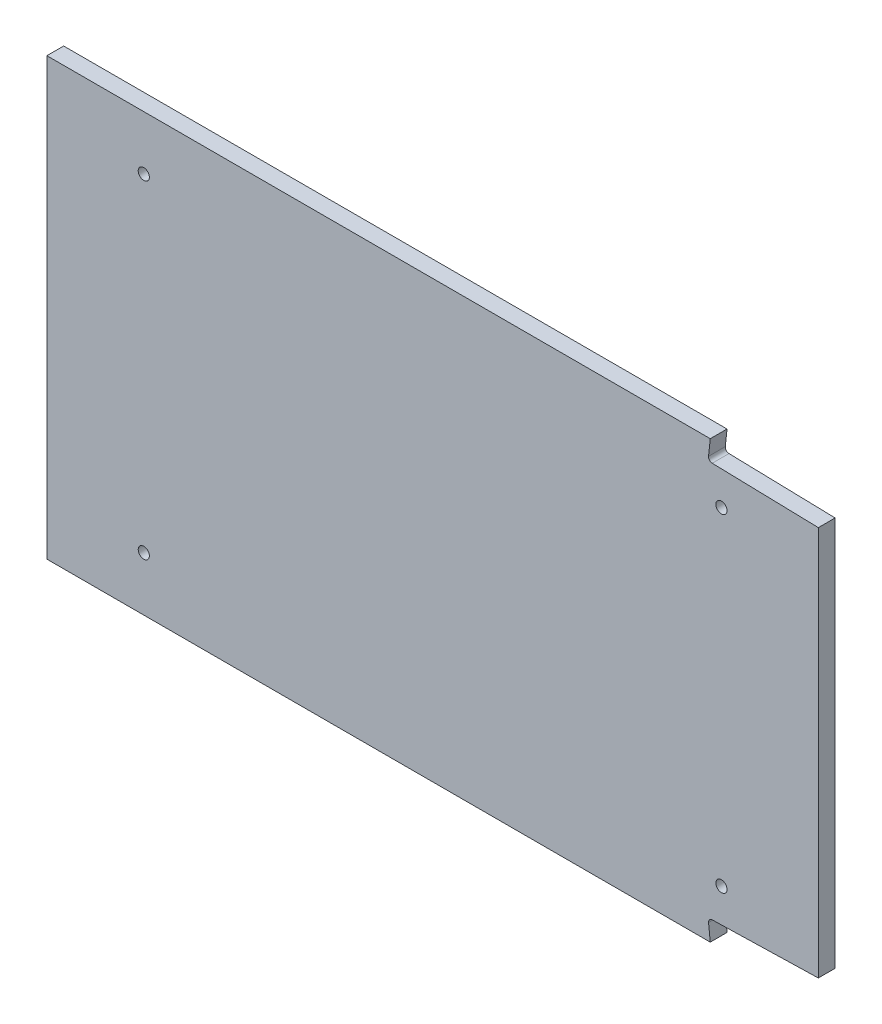
ISO-10303-21;
HEADER;
FILE_DESCRIPTION(('STEP AP214'),'2;1');
FILE_NAME('part.step','',(''),(''),'','','');
FILE_SCHEMA(('AUTOMOTIVE_DESIGN { 1 0 10303 214 1 1 1 1 }'));
ENDSEC;
DATA;
#1=APPLICATION_CONTEXT('core data for automotive mechanical design processes');
#2=APPLICATION_PROTOCOL_DEFINITION('international standard','automotive_design',2000,#1);
#3=PRODUCT_CONTEXT('',#1,'mechanical');
#4=PRODUCT('Part','Part','',(#3));
#5=PRODUCT_RELATED_PRODUCT_CATEGORY('part','',(#4));
#6=PRODUCT_DEFINITION_FORMATION('','',#4);
#7=PRODUCT_DEFINITION_CONTEXT('part definition',#1,'design');
#8=PRODUCT_DEFINITION('design','',#6,#7);
#9=PRODUCT_DEFINITION_SHAPE('','',#8);
#10=(LENGTH_UNIT() NAMED_UNIT(*) SI_UNIT(.MILLI.,.METRE.));
#11=(NAMED_UNIT(*) PLANE_ANGLE_UNIT() SI_UNIT($,.RADIAN.));
#12=(NAMED_UNIT(*) SI_UNIT($,.STERADIAN.) SOLID_ANGLE_UNIT());
#13=UNCERTAINTY_MEASURE_WITH_UNIT(LENGTH_MEASURE(1.E-05),#10,'distance_accuracy_value','');
#14=(GEOMETRIC_REPRESENTATION_CONTEXT(3) GLOBAL_UNCERTAINTY_ASSIGNED_CONTEXT((#13)) GLOBAL_UNIT_ASSIGNED_CONTEXT((#10,
#11,#12)) REPRESENTATION_CONTEXT('',''));
#15=CARTESIAN_POINT('',(0.,0.,0.));
#16=DIRECTION('',(0.,0.,1.));
#17=DIRECTION('',(1.,0.,0.));
#18=AXIS2_PLACEMENT_3D('',#15,#16,#17);
#19=CARTESIAN_POINT('',(103.5,-58.5,4.5));
#20=DIRECTION('',(0.,1.,0.));
#21=DIRECTION('',(-1.,0.,0.));
#22=AXIS2_PLACEMENT_3D('',#19,#20,#21);
#23=PLANE('',#22);
#24=DIRECTION('',(0.,0.,1.));
#25=VECTOR('',#24,1.);
#26=CARTESIAN_POINT('',(74.502602410156,-58.5,-0.00100000000000013));
#27=LINE('',#26,#25);
#28=CARTESIAN_POINT('',(74.502602410156,-58.5,0.));
#29=VERTEX_POINT('',#28);
#30=CARTESIAN_POINT('',(74.502602410156,-58.5,4.5));
#31=VERTEX_POINT('',#30);
#32=EDGE_CURVE('E115',#29,#31,#27,.T.);
#33=ORIENTED_EDGE('',*,*,#32,.T.);
#34=DIRECTION('',(1.,0.,0.));
#35=VECTOR('',#34,1.);
#36=CARTESIAN_POINT('',(103.5,-58.5,4.5));
#37=LINE('',#36,#35);
#38=CARTESIAN_POINT('',(-103.5,-58.5,4.5));
#39=VERTEX_POINT('',#38);
#40=EDGE_CURVE('E167',#39,#31,#37,.T.);
#41=ORIENTED_EDGE('',*,*,#40,.F.);
#42=DIRECTION('',(0.,0.,-1.));
#43=VECTOR('',#42,1.);
#44=CARTESIAN_POINT('',(-103.5,-58.5,4.5));
#45=LINE('',#44,#43);
#46=CARTESIAN_POINT('',(-103.5,-58.5,0.));
#47=VERTEX_POINT('',#46);
#48=EDGE_CURVE('E11',#39,#47,#45,.T.);
#49=ORIENTED_EDGE('',*,*,#48,.T.);
#50=DIRECTION('',(1.,0.,0.));
#51=VECTOR('',#50,1.);
#52=CARTESIAN_POINT('',(103.5,-58.5,0.));
#53=LINE('',#52,#51);
#54=EDGE_CURVE('E132',#47,#29,#53,.T.);
#55=ORIENTED_EDGE('',*,*,#54,.T.);
#56=EDGE_LOOP('',(#33,#41,#49,#55));
#57=FACE_BOUND('',#56,.T.);
#58=ADVANCED_FACE('F38',(#57),#23,.F.);
#59=CARTESIAN_POINT('',(103.5,-58.5,4.5));
#60=DIRECTION('',(-1.,0.,0.));
#61=DIRECTION('',(0.,0.,1.));
#62=AXIS2_PLACEMENT_3D('',#59,#60,#61);
#63=PLANE('',#62);
#64=DIRECTION('',(0.,0.,1.));
#65=VECTOR('',#64,1.);
#66=CARTESIAN_POINT('',(103.5,-52.3309475959821,-0.00100000000000013));
#67=LINE('',#66,#65);
#68=CARTESIAN_POINT('',(103.5,-52.3309475959821,0.));
#69=VERTEX_POINT('',#68);
#70=CARTESIAN_POINT('',(103.5,-52.3309475959821,4.5));
#71=VERTEX_POINT('',#70);
#72=EDGE_CURVE('E239',#69,#71,#67,.T.);
#73=ORIENTED_EDGE('',*,*,#72,.F.);
#74=DIRECTION('',(0.,1.,0.));
#75=VECTOR('',#74,1.);
#76=CARTESIAN_POINT('',(103.5,-58.5,0.));
#77=LINE('',#76,#75);
#78=CARTESIAN_POINT('',(103.5,52.3309475959821,0.));
#79=VERTEX_POINT('',#78);
#80=EDGE_CURVE('E141',#69,#79,#77,.T.);
#81=ORIENTED_EDGE('',*,*,#80,.T.);
#82=DIRECTION('',(0.,0.,1.));
#83=VECTOR('',#82,1.);
#84=CARTESIAN_POINT('',(103.5,52.3309475959821,-0.00100000000000013));
#85=LINE('',#84,#83);
#86=CARTESIAN_POINT('',(103.5,52.3309475959821,4.5));
#87=VERTEX_POINT('',#86);
#88=EDGE_CURVE('E208',#79,#87,#85,.T.);
#89=ORIENTED_EDGE('',*,*,#88,.T.);
#90=DIRECTION('',(0.,1.,0.));
#91=VECTOR('',#90,1.);
#92=CARTESIAN_POINT('',(103.5,-58.5,4.5));
#93=LINE('',#92,#91);
#94=EDGE_CURVE('E161',#71,#87,#93,.T.);
#95=ORIENTED_EDGE('',*,*,#94,.F.);
#96=EDGE_LOOP('',(#73,#81,#89,#95));
#97=FACE_BOUND('',#96,.T.);
#98=ADVANCED_FACE('F265',(#97),#63,.F.);
#99=CARTESIAN_POINT('',(0.,0.,4.5));
#100=DIRECTION('',(0.,0.,1.));
#101=DIRECTION('',(1.,0.,0.));
#102=AXIS2_PLACEMENT_3D('',#99,#100,#101);
#103=PLANE('',#102);
#104=CARTESIAN_POINT('',(77.5,-44.,4.5));
#105=DIRECTION('',(0.,0.,1.));
#106=DIRECTION('',(-1.,0.,0.));
#107=AXIS2_PLACEMENT_3D('',#104,#105,#106);
#108=CIRCLE('',#107,1.5);
#109=CARTESIAN_POINT('',(76.,-44.,4.5));
#110=VERTEX_POINT('',#109);
#111=EDGE_CURVE('E198',#110,#110,#108,.T.);
#112=ORIENTED_EDGE('',*,*,#111,.F.);
#113=EDGE_LOOP('',(#112));
#114=FACE_BOUND('',#113,.T.);
#115=CARTESIAN_POINT('',(-77.5,-44.,4.5));
#116=DIRECTION('',(0.,0.,-1.));
#117=DIRECTION('',(1.,0.,0.));
#118=AXIS2_PLACEMENT_3D('',#115,#116,#117);
#119=CIRCLE('',#118,1.5);
#120=CARTESIAN_POINT('',(-76.,-44.,4.5));
#121=VERTEX_POINT('',#120);
#122=EDGE_CURVE('E190',#121,#121,#119,.T.);
#123=ORIENTED_EDGE('',*,*,#122,.T.);
#124=EDGE_LOOP('',(#123));
#125=FACE_BOUND('',#124,.T.);
#126=CARTESIAN_POINT('',(77.5,44.,4.5));
#127=DIRECTION('',(0.,0.,-1.));
#128=DIRECTION('',(-1.,0.,0.));
#129=AXIS2_PLACEMENT_3D('',#126,#127,#128);
#130=CIRCLE('',#129,1.5);
#131=CARTESIAN_POINT('',(76.,44.,4.5));
#132=VERTEX_POINT('',#131);
#133=EDGE_CURVE('E182',#132,#132,#130,.T.);
#134=ORIENTED_EDGE('',*,*,#133,.T.);
#135=EDGE_LOOP('',(#134));
#136=FACE_BOUND('',#135,.T.);
#137=CARTESIAN_POINT('',(-77.5,44.,4.5));
#138=DIRECTION('',(0.,0.,1.));
#139=DIRECTION('',(1.,0.,0.));
#140=AXIS2_PLACEMENT_3D('',#137,#138,#139);
#141=CIRCLE('',#140,1.5);
#142=CARTESIAN_POINT('',(-76.,44.,4.5));
#143=VERTEX_POINT('',#142);
#144=EDGE_CURVE('E174',#143,#143,#141,.T.);
#145=ORIENTED_EDGE('',*,*,#144,.F.);
#146=EDGE_LOOP('',(#145));
#147=FACE_BOUND('',#146,.T.);
#148=ORIENTED_EDGE('',*,*,#40,.T.);
#149=DIRECTION('',(-0.106020446085351,0.994363949975995,0.));
#150=VECTOR('',#149,1.);
#151=CARTESIAN_POINT('',(74.502602410156,-58.5,4.5));
#152=LINE('',#151,#150);
#153=CARTESIAN_POINT('',(74.0418255120726,-54.1783813561109,4.5));
#154=VERTEX_POINT('',#153);
#155=EDGE_CURVE('E121',#31,#154,#152,.T.);
#156=ORIENTED_EDGE('',*,*,#155,.T.);
#157=CARTESIAN_POINT('',(75.0509354151962,-54.070788676307,4.5));
#158=DIRECTION('',(0.,0.,-1.));
#159=DIRECTION('',(1.,0.,0.));
#160=AXIS2_PLACEMENT_3D('',#157,#158,#159);
#161=CIRCLE('',#160,1.01482953313816);
#162=CARTESIAN_POINT('',(75.0250930692009,-53.0562882305295,4.5));
#163=VERTEX_POINT('',#162);
#164=EDGE_CURVE('E248',#154,#163,#161,.T.);
#165=ORIENTED_EDGE('',*,*,#164,.T.);
#166=DIRECTION('',(0.999675721537608,0.0254647161433701,0.));
#167=VECTOR('',#166,1.);
#168=CARTESIAN_POINT('',(75.0250930692009,-53.0562882305295,4.5));
#169=LINE('',#168,#167);
#170=EDGE_CURVE('E136',#163,#71,#169,.T.);
#171=ORIENTED_EDGE('',*,*,#170,.T.);
#172=ORIENTED_EDGE('',*,*,#94,.T.);
#173=DIRECTION('',(0.999675721537608,-0.0254647161433701,0.));
#174=VECTOR('',#173,1.);
#175=CARTESIAN_POINT('',(75.0250930692009,53.0562882305295,4.5));
#176=LINE('',#175,#174);
#177=CARTESIAN_POINT('',(75.0250930692009,53.0562882305295,4.5));
#178=VERTEX_POINT('',#177);
#179=EDGE_CURVE('E213',#178,#87,#176,.T.);
#180=ORIENTED_EDGE('',*,*,#179,.F.);
#181=CARTESIAN_POINT('',(75.0509354151962,54.070788676307,4.5));
#182=DIRECTION('',(0.,0.,1.));
#183=DIRECTION('',(1.,0.,0.));
#184=AXIS2_PLACEMENT_3D('',#181,#182,#183);
#185=CIRCLE('',#184,1.01482953313816);
#186=CARTESIAN_POINT('',(74.0418255120726,54.1783813561109,4.5));
#187=VERTEX_POINT('',#186);
#188=EDGE_CURVE('E225',#187,#178,#185,.T.);
#189=ORIENTED_EDGE('',*,*,#188,.F.);
#190=DIRECTION('',(-0.106020446085351,-0.994363949975995,0.));
#191=VECTOR('',#190,1.);
#192=CARTESIAN_POINT('',(74.502602410156,58.5,4.5));
#193=LINE('',#192,#191);
#194=CARTESIAN_POINT('',(74.502602410156,58.5,4.5));
#195=VERTEX_POINT('',#194);
#196=EDGE_CURVE('E229',#195,#187,#193,.T.);
#197=ORIENTED_EDGE('',*,*,#196,.F.);
#198=DIRECTION('',(-1.,0.,0.));
#199=VECTOR('',#198,1.);
#200=CARTESIAN_POINT('',(103.5,58.5,4.5));
#201=LINE('',#200,#199);
#202=CARTESIAN_POINT('',(-103.5,58.5,4.5));
#203=VERTEX_POINT('',#202);
#204=EDGE_CURVE('E156',#195,#203,#201,.T.);
#205=ORIENTED_EDGE('',*,*,#204,.T.);
#206=DIRECTION('',(0.,-1.,0.));
#207=VECTOR('',#206,1.);
#208=CARTESIAN_POINT('',(-103.5,-58.5,4.5));
#209=LINE('',#208,#207);
#210=EDGE_CURVE('E153',#203,#39,#209,.T.);
#211=ORIENTED_EDGE('',*,*,#210,.T.);
#212=EDGE_LOOP('',(#148,#156,#165,#171,#172,#180,#189,#197,#205,#211));
#213=FACE_BOUND('',#212,.T.);
#214=ADVANCED_FACE('F268',(#114,#125,#136,#147,#213),#103,.T.);
#215=CARTESIAN_POINT('',(0.,0.,0.));
#216=DIRECTION('',(0.,0.,1.));
#217=DIRECTION('',(1.,0.,0.));
#218=AXIS2_PLACEMENT_3D('',#215,#216,#217);
#219=PLANE('',#218);
#220=CARTESIAN_POINT('',(-77.5,44.,0.));
#221=DIRECTION('',(0.,0.,1.));
#222=DIRECTION('',(1.,0.,0.));
#223=AXIS2_PLACEMENT_3D('',#220,#221,#222);
#224=CIRCLE('',#223,1.5);
#225=CARTESIAN_POINT('',(-76.,44.,0.));
#226=VERTEX_POINT('',#225);
#227=EDGE_CURVE('E148',#226,#226,#224,.T.);
#228=ORIENTED_EDGE('',*,*,#227,.T.);
#229=EDGE_LOOP('',(#228));
#230=FACE_BOUND('',#229,.T.);
#231=CARTESIAN_POINT('',(77.5,44.,0.));
#232=DIRECTION('',(0.,0.,-1.));
#233=DIRECTION('',(-1.,0.,0.));
#234=AXIS2_PLACEMENT_3D('',#231,#232,#233);
#235=CIRCLE('',#234,1.5);
#236=CARTESIAN_POINT('',(76.,44.,0.));
#237=VERTEX_POINT('',#236);
#238=EDGE_CURVE('E178',#237,#237,#235,.T.);
#239=ORIENTED_EDGE('',*,*,#238,.F.);
#240=EDGE_LOOP('',(#239));
#241=FACE_BOUND('',#240,.T.);
#242=CARTESIAN_POINT('',(-77.5,-44.,0.));
#243=DIRECTION('',(0.,0.,-1.));
#244=DIRECTION('',(1.,0.,0.));
#245=AXIS2_PLACEMENT_3D('',#242,#243,#244);
#246=CIRCLE('',#245,1.5);
#247=CARTESIAN_POINT('',(-76.,-44.,0.));
#248=VERTEX_POINT('',#247);
#249=EDGE_CURVE('E186',#248,#248,#246,.T.);
#250=ORIENTED_EDGE('',*,*,#249,.F.);
#251=EDGE_LOOP('',(#250));
#252=FACE_BOUND('',#251,.T.);
#253=CARTESIAN_POINT('',(77.5,-44.,0.));
#254=DIRECTION('',(0.,0.,1.));
#255=DIRECTION('',(-1.,0.,0.));
#256=AXIS2_PLACEMENT_3D('',#253,#254,#255);
#257=CIRCLE('',#256,1.5);
#258=CARTESIAN_POINT('',(76.,-44.,0.));
#259=VERTEX_POINT('',#258);
#260=EDGE_CURVE('E194',#259,#259,#257,.T.);
#261=ORIENTED_EDGE('',*,*,#260,.T.);
#262=EDGE_LOOP('',(#261));
#263=FACE_BOUND('',#262,.T.);
#264=DIRECTION('',(0.106020446085351,-0.994363949975995,0.));
#265=VECTOR('',#264,1.);
#266=CARTESIAN_POINT('',(74.502602410156,-58.5,0.));
#267=LINE('',#266,#265);
#268=CARTESIAN_POINT('',(74.0418255120726,-54.1783813561109,0.));
#269=VERTEX_POINT('',#268);
#270=EDGE_CURVE('E118',#269,#29,#267,.T.);
#271=ORIENTED_EDGE('',*,*,#270,.T.);
#272=ORIENTED_EDGE('',*,*,#54,.F.);
#273=DIRECTION('',(0.,-1.,0.));
#274=VECTOR('',#273,1.);
#275=CARTESIAN_POINT('',(-103.5,-58.5,0.));
#276=LINE('',#275,#274);
#277=CARTESIAN_POINT('',(-103.5,58.5,0.));
#278=VERTEX_POINT('',#277);
#279=EDGE_CURVE('E142',#278,#47,#276,.T.);
#280=ORIENTED_EDGE('',*,*,#279,.F.);
#281=DIRECTION('',(-1.,0.,0.));
#282=VECTOR('',#281,1.);
#283=CARTESIAN_POINT('',(103.5,58.5,0.));
#284=LINE('',#283,#282);
#285=CARTESIAN_POINT('',(74.502602410156,58.5,0.));
#286=VERTEX_POINT('',#285);
#287=EDGE_CURVE('E146',#286,#278,#284,.T.);
#288=ORIENTED_EDGE('',*,*,#287,.F.);
#289=DIRECTION('',(0.106020446085351,0.994363949975995,0.));
#290=VECTOR('',#289,1.);
#291=CARTESIAN_POINT('',(74.502602410156,58.5,0.));
#292=LINE('',#291,#290);
#293=CARTESIAN_POINT('',(74.0418255120726,54.1783813561109,0.));
#294=VERTEX_POINT('',#293);
#295=EDGE_CURVE('E202',#294,#286,#292,.T.);
#296=ORIENTED_EDGE('',*,*,#295,.F.);
#297=CARTESIAN_POINT('',(75.0509354151962,54.070788676307,0.));
#298=DIRECTION('',(0.,0.,1.));
#299=DIRECTION('',(1.,0.,0.));
#300=AXIS2_PLACEMENT_3D('',#297,#298,#299);
#301=CIRCLE('',#300,1.01482953313816);
#302=CARTESIAN_POINT('',(75.0250930692009,53.0562882305295,0.));
#303=VERTEX_POINT('',#302);
#304=EDGE_CURVE('E62',#303,#294,#301,.F.);
#305=ORIENTED_EDGE('',*,*,#304,.F.);
#306=DIRECTION('',(-0.999675721537608,0.0254647161433701,0.));
#307=VECTOR('',#306,1.);
#308=CARTESIAN_POINT('',(75.0250930692009,53.0562882305295,0.));
#309=LINE('',#308,#307);
#310=EDGE_CURVE('E233',#79,#303,#309,.T.);
#311=ORIENTED_EDGE('',*,*,#310,.F.);
#312=ORIENTED_EDGE('',*,*,#80,.F.);
#313=DIRECTION('',(-0.999675721537608,-0.0254647161433701,0.));
#314=VECTOR('',#313,1.);
#315=CARTESIAN_POINT('',(75.0250930692009,-53.0562882305295,0.));
#316=LINE('',#315,#314);
#317=CARTESIAN_POINT('',(75.0250930692009,-53.0562882305295,0.));
#318=VERTEX_POINT('',#317);
#319=EDGE_CURVE('E257',#69,#318,#316,.T.);
#320=ORIENTED_EDGE('',*,*,#319,.T.);
#321=CARTESIAN_POINT('',(75.0509354151962,-54.070788676307,0.));
#322=DIRECTION('',(0.,0.,1.));
#323=DIRECTION('',(1.,0.,0.));
#324=AXIS2_PLACEMENT_3D('',#321,#322,#323);
#325=CIRCLE('',#324,1.01482953313816);
#326=EDGE_CURVE('E134',#318,#269,#325,.T.);
#327=ORIENTED_EDGE('',*,*,#326,.T.);
#328=EDGE_LOOP('',(#271,#272,#280,#288,#296,#305,#311,#312,#320,#327));
#329=FACE_BOUND('',#328,.T.);
#330=ADVANCED_FACE('F130',(#230,#241,#252,#263,#329),#219,.F.);
#331=CARTESIAN_POINT('',(-103.5,-58.5,4.5));
#332=DIRECTION('',(1.,0.,0.));
#333=DIRECTION('',(0.,0.,-1.));
#334=AXIS2_PLACEMENT_3D('',#331,#332,#333);
#335=PLANE('',#334);
#336=ORIENTED_EDGE('',*,*,#279,.T.);
#337=ORIENTED_EDGE('',*,*,#48,.F.);
#338=ORIENTED_EDGE('',*,*,#210,.F.);
#339=DIRECTION('',(0.,0.,-1.));
#340=VECTOR('',#339,1.);
#341=CARTESIAN_POINT('',(-103.5,58.5,4.5));
#342=LINE('',#341,#340);
#343=EDGE_CURVE('E47',#203,#278,#342,.T.);
#344=ORIENTED_EDGE('',*,*,#343,.T.);
#345=EDGE_LOOP('',(#336,#337,#338,#344));
#346=FACE_BOUND('',#345,.T.);
#347=ADVANCED_FACE('F40',(#346),#335,.F.);
#348=CARTESIAN_POINT('',(103.5,58.5,4.5));
#349=DIRECTION('',(0.,-1.,0.));
#350=DIRECTION('',(1.,0.,0.));
#351=AXIS2_PLACEMENT_3D('',#348,#349,#350);
#352=PLANE('',#351);
#353=ORIENTED_EDGE('',*,*,#204,.F.);
#354=DIRECTION('',(0.,0.,1.));
#355=VECTOR('',#354,1.);
#356=CARTESIAN_POINT('',(74.502602410156,58.5,-0.00100000000000013));
#357=LINE('',#356,#355);
#358=EDGE_CURVE('E209',#286,#195,#357,.T.);
#359=ORIENTED_EDGE('',*,*,#358,.F.);
#360=ORIENTED_EDGE('',*,*,#287,.T.);
#361=ORIENTED_EDGE('',*,*,#343,.F.);
#362=EDGE_LOOP('',(#353,#359,#360,#361));
#363=FACE_BOUND('',#362,.T.);
#364=ADVANCED_FACE('F276',(#363),#352,.F.);
#365=CARTESIAN_POINT('',(-77.5,44.,0.));
#366=DIRECTION('',(0.,0.,1.));
#367=DIRECTION('',(1.,0.,0.));
#368=AXIS2_PLACEMENT_3D('',#365,#366,#367);
#369=CYLINDRICAL_SURFACE('',#368,1.5);
#370=ORIENTED_EDGE('',*,*,#227,.F.);
#371=EDGE_LOOP('',(#370));
#372=FACE_BOUND('',#371,.T.);
#373=ORIENTED_EDGE('',*,*,#144,.T.);
#374=EDGE_LOOP('',(#373));
#375=FACE_BOUND('',#374,.T.);
#376=ADVANCED_FACE('F299',(#372,#375),#369,.F.);
#377=CARTESIAN_POINT('',(77.5,44.,0.));
#378=DIRECTION('',(0.,0.,1.));
#379=DIRECTION('',(1.,0.,0.));
#380=AXIS2_PLACEMENT_3D('',#377,#378,#379);
#381=CYLINDRICAL_SURFACE('',#380,1.5);
#382=ORIENTED_EDGE('',*,*,#238,.T.);
#383=EDGE_LOOP('',(#382));
#384=FACE_BOUND('',#383,.T.);
#385=ORIENTED_EDGE('',*,*,#133,.F.);
#386=EDGE_LOOP('',(#385));
#387=FACE_BOUND('',#386,.T.);
#388=ADVANCED_FACE('F308',(#384,#387),#381,.F.);
#389=CARTESIAN_POINT('',(-77.5,-44.,0.));
#390=DIRECTION('',(0.,0.,1.));
#391=DIRECTION('',(1.,0.,0.));
#392=AXIS2_PLACEMENT_3D('',#389,#390,#391);
#393=CYLINDRICAL_SURFACE('',#392,1.5);
#394=ORIENTED_EDGE('',*,*,#249,.T.);
#395=EDGE_LOOP('',(#394));
#396=FACE_BOUND('',#395,.T.);
#397=ORIENTED_EDGE('',*,*,#122,.F.);
#398=EDGE_LOOP('',(#397));
#399=FACE_BOUND('',#398,.T.);
#400=ADVANCED_FACE('F312',(#396,#399),#393,.F.);
#401=CARTESIAN_POINT('',(77.5,-44.,0.));
#402=DIRECTION('',(0.,0.,1.));
#403=DIRECTION('',(1.,0.,0.));
#404=AXIS2_PLACEMENT_3D('',#401,#402,#403);
#405=CYLINDRICAL_SURFACE('',#404,1.5);
#406=ORIENTED_EDGE('',*,*,#260,.F.);
#407=EDGE_LOOP('',(#406));
#408=FACE_BOUND('',#407,.T.);
#409=ORIENTED_EDGE('',*,*,#111,.T.);
#410=EDGE_LOOP('',(#409));
#411=FACE_BOUND('',#410,.T.);
#412=ADVANCED_FACE('F316',(#408,#411),#405,.F.);
#413=CARTESIAN_POINT('',(75.0250930692009,53.0562882305295,-0.00100000000000013));
#414=DIRECTION('',(-0.0254647161433701,-0.999675721537608,0.));
#415=DIRECTION('',(0.999675721537608,-0.0254647161433701,0.));
#416=AXIS2_PLACEMENT_3D('',#413,#414,#415);
#417=PLANE('',#416);
#418=ORIENTED_EDGE('',*,*,#310,.T.);
#419=DIRECTION('',(0.,0.,1.));
#420=VECTOR('',#419,1.);
#421=CARTESIAN_POINT('',(75.0250930692009,53.0562882305295,-0.00100000000000013));
#422=LINE('',#421,#420);
#423=EDGE_CURVE('E216',#303,#178,#422,.T.);
#424=ORIENTED_EDGE('',*,*,#423,.T.);
#425=ORIENTED_EDGE('',*,*,#179,.T.);
#426=ORIENTED_EDGE('',*,*,#88,.F.);
#427=EDGE_LOOP('',(#418,#424,#425,#426));
#428=FACE_BOUND('',#427,.T.);
#429=ADVANCED_FACE('F271',(#428),#417,.F.);
#430=CARTESIAN_POINT('',(75.0509354151962,54.070788676307,-0.00100000000000013));
#431=DIRECTION('',(0.,0.,1.));
#432=DIRECTION('',(1.,0.,0.));
#433=AXIS2_PLACEMENT_3D('',#430,#431,#432);
#434=CYLINDRICAL_SURFACE('',#433,1.01482953313816);
#435=ORIENTED_EDGE('',*,*,#304,.T.);
#436=DIRECTION('',(0.,0.,1.));
#437=VECTOR('',#436,1.);
#438=CARTESIAN_POINT('',(74.0418255120726,54.1783813561109,-0.00100000000000013));
#439=LINE('',#438,#437);
#440=EDGE_CURVE('E212',#294,#187,#439,.T.);
#441=ORIENTED_EDGE('',*,*,#440,.T.);
#442=ORIENTED_EDGE('',*,*,#188,.T.);
#443=ORIENTED_EDGE('',*,*,#423,.F.);
#444=EDGE_LOOP('',(#435,#441,#442,#443));
#445=FACE_BOUND('',#444,.T.);
#446=ADVANCED_FACE('F272',(#445),#434,.F.);
#447=CARTESIAN_POINT('',(74.502602410156,58.5,-0.00100000000000013));
#448=DIRECTION('',(-0.994363949975995,0.106020446085351,0.));
#449=DIRECTION('',(-0.106020446085351,-0.994363949975995,0.));
#450=AXIS2_PLACEMENT_3D('',#447,#448,#449);
#451=PLANE('',#450);
#452=ORIENTED_EDGE('',*,*,#295,.T.);
#453=ORIENTED_EDGE('',*,*,#358,.T.);
#454=ORIENTED_EDGE('',*,*,#196,.T.);
#455=ORIENTED_EDGE('',*,*,#440,.F.);
#456=EDGE_LOOP('',(#452,#453,#454,#455));
#457=FACE_BOUND('',#456,.T.);
#458=ADVANCED_FACE('F288',(#457),#451,.F.);
#459=CARTESIAN_POINT('',(74.502602410156,-58.5,-0.00100000000000013));
#460=DIRECTION('',(0.994363949975995,0.106020446085351,0.));
#461=DIRECTION('',(-0.106020446085351,0.994363949975995,0.));
#462=AXIS2_PLACEMENT_3D('',#459,#460,#461);
#463=PLANE('',#462);
#464=DIRECTION('',(0.,0.,1.));
#465=VECTOR('',#464,1.);
#466=CARTESIAN_POINT('',(74.0418255120726,-54.1783813561109,-0.00100000000000013));
#467=LINE('',#466,#465);
#468=EDGE_CURVE('E126',#269,#154,#467,.T.);
#469=ORIENTED_EDGE('',*,*,#468,.T.);
#470=ORIENTED_EDGE('',*,*,#155,.F.);
#471=ORIENTED_EDGE('',*,*,#32,.F.);
#472=ORIENTED_EDGE('',*,*,#270,.F.);
#473=EDGE_LOOP('',(#469,#470,#471,#472));
#474=FACE_BOUND('',#473,.T.);
#475=ADVANCED_FACE('F117',(#474),#463,.T.);
#476=CARTESIAN_POINT('',(75.0509354151962,-54.070788676307,-0.00100000000000013));
#477=DIRECTION('',(0.,0.,1.));
#478=DIRECTION('',(1.,0.,0.));
#479=AXIS2_PLACEMENT_3D('',#476,#477,#478);
#480=CYLINDRICAL_SURFACE('',#479,1.01482953313816);
#481=DIRECTION('',(0.,0.,1.));
#482=VECTOR('',#481,1.);
#483=CARTESIAN_POINT('',(75.0250930692009,-53.0562882305295,-0.00100000000000013));
#484=LINE('',#483,#482);
#485=EDGE_CURVE('E54',#318,#163,#484,.T.);
#486=ORIENTED_EDGE('',*,*,#485,.T.);
#487=ORIENTED_EDGE('',*,*,#164,.F.);
#488=ORIENTED_EDGE('',*,*,#468,.F.);
#489=ORIENTED_EDGE('',*,*,#326,.F.);
#490=EDGE_LOOP('',(#486,#487,#488,#489));
#491=FACE_BOUND('',#490,.T.);
#492=ADVANCED_FACE('F280',(#491),#480,.F.);
#493=CARTESIAN_POINT('',(75.0250930692009,-53.0562882305295,-0.00100000000000013));
#494=DIRECTION('',(0.0254647161433701,-0.999675721537608,0.));
#495=DIRECTION('',(0.999675721537608,0.0254647161433701,0.));
#496=AXIS2_PLACEMENT_3D('',#493,#494,#495);
#497=PLANE('',#496);
#498=ORIENTED_EDGE('',*,*,#72,.T.);
#499=ORIENTED_EDGE('',*,*,#170,.F.);
#500=ORIENTED_EDGE('',*,*,#485,.F.);
#501=ORIENTED_EDGE('',*,*,#319,.F.);
#502=EDGE_LOOP('',(#498,#499,#500,#501));
#503=FACE_BOUND('',#502,.T.);
#504=ADVANCED_FACE('F262',(#503),#497,.T.);
#505=CLOSED_SHELL('',(#58,#98,#214,#330,#347,#364,#376,#388,#400,#412,#429,#446,#458,#475,#492,#504));
#506=MANIFOLD_SOLID_BREP('B2',#505);
#507=ADVANCED_BREP_SHAPE_REPRESENTATION('',(#18,#506),#14);
#508=SHAPE_DEFINITION_REPRESENTATION(#9,#507);
ENDSEC;
END-ISO-10303-21;
